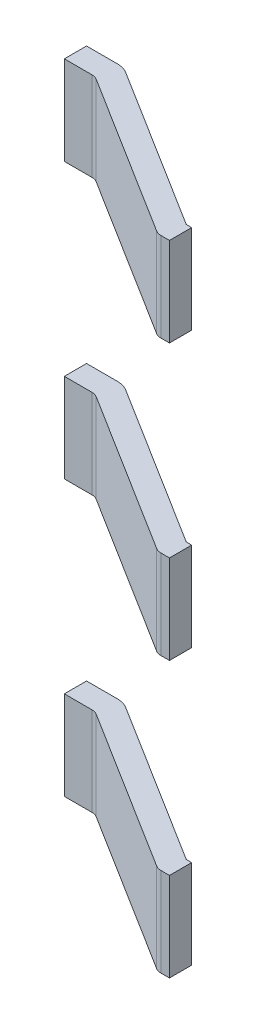
ISO-10303-21;
HEADER;
FILE_DESCRIPTION(('STEP AP214'),'2;1');
FILE_NAME('part.step','',(''),(''),'','','');
FILE_SCHEMA(('AUTOMOTIVE_DESIGN { 1 0 10303 214 1 1 1 1 }'));
ENDSEC;
DATA;
#1=APPLICATION_CONTEXT('core data for automotive mechanical design processes');
#2=APPLICATION_PROTOCOL_DEFINITION('international standard','automotive_design',2000,#1);
#3=PRODUCT_CONTEXT('',#1,'mechanical');
#4=PRODUCT('Part','Part','',(#3));
#5=PRODUCT_RELATED_PRODUCT_CATEGORY('part','',(#4));
#6=PRODUCT_DEFINITION_FORMATION('','',#4);
#7=PRODUCT_DEFINITION_CONTEXT('part definition',#1,'design');
#8=PRODUCT_DEFINITION('design','',#6,#7);
#9=PRODUCT_DEFINITION_SHAPE('','',#8);
#10=(LENGTH_UNIT() NAMED_UNIT(*) SI_UNIT(.MILLI.,.METRE.));
#11=(NAMED_UNIT(*) PLANE_ANGLE_UNIT() SI_UNIT($,.RADIAN.));
#12=(NAMED_UNIT(*) SI_UNIT($,.STERADIAN.) SOLID_ANGLE_UNIT());
#13=UNCERTAINTY_MEASURE_WITH_UNIT(LENGTH_MEASURE(1.E-05),#10,'distance_accuracy_value','');
#14=(GEOMETRIC_REPRESENTATION_CONTEXT(3) GLOBAL_UNCERTAINTY_ASSIGNED_CONTEXT((#13)) GLOBAL_UNIT_ASSIGNED_CONTEXT((#10,
#11,#12)) REPRESENTATION_CONTEXT('',''));
#15=CARTESIAN_POINT('',(0.,0.,0.));
#16=DIRECTION('',(0.,0.,1.));
#17=DIRECTION('',(1.,0.,0.));
#18=AXIS2_PLACEMENT_3D('',#15,#16,#17);
#19=CARTESIAN_POINT('',(-1.824104576066,1.92,0.964303036979));
#20=DIRECTION('',(0.,1.,0.));
#21=DIRECTION('',(-0.530661276733133,0.,0.847583983671212));
#22=AXIS2_PLACEMENT_3D('',#19,#20,#21);
#23=CYLINDRICAL_SURFACE('',#22,0.0925);
#24=CARTESIAN_POINT('',(-1.824104576066,1.92,0.964303036979));
#25=DIRECTION('',(0.,1.,0.));
#26=DIRECTION('',(0.,0.,1.));
#27=AXIS2_PLACEMENT_3D('',#24,#25,#26);
#28=CIRCLE('',#27,0.0925);
#29=CARTESIAN_POINT('',(-1.873190744164,1.92,1.042704555469));
#30=VERTEX_POINT('',#29);
#31=CARTESIAN_POINT('',(-1.824104576066,1.92,1.056803036979));
#32=VERTEX_POINT('',#31);
#33=EDGE_CURVE('P0_E163',#30,#32,#28,.T.);
#34=ORIENTED_EDGE('',*,*,#33,.T.);
#35=DIRECTION('',(0.,1.,0.));
#36=VECTOR('',#35,1.);
#37=CARTESIAN_POINT('',(-1.824104576066,1.92,1.056803036979));
#38=LINE('',#37,#36);
#39=CARTESIAN_POINT('',(-1.824104576066,2.66,1.056803036979));
#40=VERTEX_POINT('',#39);
#41=EDGE_CURVE('P0_E11',#32,#40,#38,.T.);
#42=ORIENTED_EDGE('',*,*,#41,.T.);
#43=CARTESIAN_POINT('',(-1.824104576066,2.66,0.964303036979));
#44=DIRECTION('',(0.,1.,0.));
#45=DIRECTION('',(0.,0.,1.));
#46=AXIS2_PLACEMENT_3D('',#43,#44,#45);
#47=CIRCLE('',#46,0.0925);
#48=CARTESIAN_POINT('',(-1.873190744164,2.66,1.042704555469));
#49=VERTEX_POINT('',#48);
#50=EDGE_CURVE('P0_E183',#49,#40,#47,.T.);
#51=ORIENTED_EDGE('',*,*,#50,.F.);
#52=DIRECTION('',(0.,1.,0.));
#53=VECTOR('',#52,1.);
#54=CARTESIAN_POINT('',(-1.873190744164,1.92,1.042704555469));
#55=LINE('',#54,#53);
#56=EDGE_CURVE('P0_E26',#30,#49,#55,.T.);
#57=ORIENTED_EDGE('',*,*,#56,.F.);
#58=EDGE_LOOP('',(#34,#42,#51,#57));
#59=FACE_BOUND('',#58,.T.);
#60=ADVANCED_FACE('P0_F17',(#59),#23,.T.);
#61=CARTESIAN_POINT('',(-1.850672336196,1.92,1.056803036979));
#62=DIRECTION('',(0.,0.,1.));
#63=DIRECTION('',(1.,0.,0.));
#64=AXIS2_PLACEMENT_3D('',#61,#62,#63);
#65=PLANE('',#64);
#66=DIRECTION('',(1.,0.,0.));
#67=VECTOR('',#66,1.);
#68=CARTESIAN_POINT('',(-1.850672336196,1.92,1.056803036979));
#69=LINE('',#68,#67);
#70=CARTESIAN_POINT('',(-1.7525,1.92,1.056803036979));
#71=VERTEX_POINT('',#70);
#72=EDGE_CURVE('P0_E194',#32,#71,#69,.T.);
#73=ORIENTED_EDGE('',*,*,#72,.T.);
#74=DIRECTION('',(0.,1.,0.));
#75=VECTOR('',#74,1.);
#76=CARTESIAN_POINT('',(-1.7525,1.92,1.056803036979));
#77=LINE('',#76,#75);
#78=CARTESIAN_POINT('',(-1.7525,2.66,1.056803036979));
#79=VERTEX_POINT('',#78);
#80=EDGE_CURVE('P0_E227',#71,#79,#77,.T.);
#81=ORIENTED_EDGE('',*,*,#80,.T.);
#82=DIRECTION('',(1.,0.,0.));
#83=VECTOR('',#82,1.);
#84=CARTESIAN_POINT('',(-1.850672336196,2.66,1.056803036979));
#85=LINE('',#84,#83);
#86=EDGE_CURVE('P0_E187',#40,#79,#85,.T.);
#87=ORIENTED_EDGE('',*,*,#86,.F.);
#88=ORIENTED_EDGE('',*,*,#41,.F.);
#89=EDGE_LOOP('',(#73,#81,#87,#88));
#90=FACE_BOUND('',#89,.T.);
#91=ADVANCED_FACE('P0_F438',(#90),#65,.T.);
#92=CARTESIAN_POINT('',(-3.288172336196,1.92,0.156803036979));
#93=DIRECTION('',(0.530661276733133,0.,-0.847583983671212));
#94=DIRECTION('',(0.,-1.,0.));
#95=AXIS2_PLACEMENT_3D('',#92,#93,#94);
#96=PLANE('',#95);
#97=ORIENTED_EDGE('',*,*,#56,.T.);
#98=DIRECTION('',(0.847583983671212,0.,0.530661276733133));
#99=VECTOR('',#98,1.);
#100=CARTESIAN_POINT('',(-3.288172336196,2.66,0.156803036979));
#101=LINE('',#100,#99);
#102=CARTESIAN_POINT('',(-3.220617112292,2.66,0.19909848151));
#103=VERTEX_POINT('',#102);
#104=EDGE_CURVE('P0_E188',#103,#49,#101,.T.);
#105=ORIENTED_EDGE('',*,*,#104,.F.);
#106=DIRECTION('',(0.,1.,0.));
#107=VECTOR('',#106,1.);
#108=CARTESIAN_POINT('',(-3.220617112292,1.92,0.19909848151));
#109=LINE('',#108,#107);
#110=CARTESIAN_POINT('',(-3.220617112292,1.92,0.19909848151));
#111=VERTEX_POINT('',#110);
#112=EDGE_CURVE('P0_E179',#111,#103,#109,.T.);
#113=ORIENTED_EDGE('',*,*,#112,.F.);
#114=DIRECTION('',(0.847583983671212,0.,0.530661276733133));
#115=VECTOR('',#114,1.);
#116=CARTESIAN_POINT('',(-3.288172336196,1.92,0.156803036979));
#117=LINE('',#116,#115);
#118=EDGE_CURVE('P0_E240',#111,#30,#117,.T.);
#119=ORIENTED_EDGE('',*,*,#118,.T.);
#120=EDGE_LOOP('',(#97,#105,#113,#119));
#121=FACE_BOUND('',#120,.T.);
#122=ADVANCED_FACE('P0_F19',(#121),#96,.F.);
#123=CARTESIAN_POINT('',(-1.7525,1.92,0.871803036979));
#124=DIRECTION('',(1.,0.,0.));
#125=DIRECTION('',(0.,1.,0.));
#126=AXIS2_PLACEMENT_3D('',#123,#124,#125);
#127=PLANE('',#126);
#128=DIRECTION('',(0.,0.,1.));
#129=VECTOR('',#128,1.);
#130=CARTESIAN_POINT('',(-1.7525,1.92,0.871803036979));
#131=LINE('',#130,#129);
#132=CARTESIAN_POINT('',(-1.7525,1.92,0.871803036979));
#133=VERTEX_POINT('',#132);
#134=EDGE_CURVE('P0_E197',#133,#71,#131,.T.);
#135=ORIENTED_EDGE('',*,*,#134,.F.);
#136=DIRECTION('',(0.,1.,0.));
#137=VECTOR('',#136,1.);
#138=CARTESIAN_POINT('',(-1.7525,1.92,0.871803036979));
#139=LINE('',#138,#137);
#140=CARTESIAN_POINT('',(-1.7525,2.66,0.871803036979));
#141=VERTEX_POINT('',#140);
#142=EDGE_CURVE('P0_E230',#133,#141,#139,.T.);
#143=ORIENTED_EDGE('',*,*,#142,.T.);
#144=DIRECTION('',(0.,0.,1.));
#145=VECTOR('',#144,1.);
#146=CARTESIAN_POINT('',(-1.7525,2.66,0.871803036979));
#147=LINE('',#146,#145);
#148=EDGE_CURVE('P0_E205',#141,#79,#147,.T.);
#149=ORIENTED_EDGE('',*,*,#148,.T.);
#150=ORIENTED_EDGE('',*,*,#80,.F.);
#151=EDGE_LOOP('',(#135,#143,#149,#150));
#152=FACE_BOUND('',#151,.T.);
#153=ADVANCED_FACE('P0_F432',(#152),#127,.T.);
#154=CARTESIAN_POINT('',(-1.850672336196,1.92,0.871803036979));
#155=DIRECTION('',(0.,0.,1.));
#156=DIRECTION('',(1.,0.,0.));
#157=AXIS2_PLACEMENT_3D('',#154,#155,#156);
#158=PLANE('',#157);
#159=ORIENTED_EDGE('',*,*,#142,.F.);
#160=DIRECTION('',(1.,0.,0.));
#161=VECTOR('',#160,1.);
#162=CARTESIAN_POINT('',(-1.850672336196,1.92,0.871803036979));
#163=LINE('',#162,#161);
#164=CARTESIAN_POINT('',(-1.797536815936,1.92,0.871803036979));
#165=VERTEX_POINT('',#164);
#166=EDGE_CURVE('P0_E171',#165,#133,#163,.T.);
#167=ORIENTED_EDGE('',*,*,#166,.F.);
#168=DIRECTION('',(0.,1.,0.));
#169=VECTOR('',#168,1.);
#170=CARTESIAN_POINT('',(-1.797536815936,1.92,0.871803036979));
#171=LINE('',#170,#169);
#172=CARTESIAN_POINT('',(-1.797536815936,2.66,0.871803036979));
#173=VERTEX_POINT('',#172);
#174=EDGE_CURVE('P0_E249',#165,#173,#171,.T.);
#175=ORIENTED_EDGE('',*,*,#174,.T.);
#176=DIRECTION('',(1.,0.,0.));
#177=VECTOR('',#176,1.);
#178=CARTESIAN_POINT('',(-1.850672336196,2.66,0.871803036979));
#179=LINE('',#178,#177);
#180=EDGE_CURVE('P0_E206',#173,#141,#179,.T.);
#181=ORIENTED_EDGE('',*,*,#180,.T.);
#182=EDGE_LOOP('',(#159,#167,#175,#181));
#183=FACE_BOUND('',#182,.T.);
#184=ADVANCED_FACE('P0_F379',(#183),#158,.F.);
#185=CARTESIAN_POINT('',(-3.19,1.92,0.));
#186=DIRECTION('',(0.530661276733133,0.,-0.847583983671212));
#187=DIRECTION('',(0.,-1.,0.));
#188=AXIS2_PLACEMENT_3D('',#185,#186,#187);
#189=PLANE('',#188);
#190=DIRECTION('',(0.847583983671212,0.,0.530661276733133));
#191=VECTOR('',#190,1.);
#192=CARTESIAN_POINT('',(-3.19,1.92,0.));
#193=LINE('',#192,#191);
#194=CARTESIAN_POINT('',(-3.144963184064,1.92,0.02819696302084));
#195=VERTEX_POINT('',#194);
#196=EDGE_CURVE('P0_E167',#195,#165,#193,.T.);
#197=ORIENTED_EDGE('',*,*,#196,.F.);
#198=DIRECTION('',(0.,1.,0.));
#199=VECTOR('',#198,1.);
#200=CARTESIAN_POINT('',(-3.144963184064,1.92,0.02819696302084));
#201=LINE('',#200,#199);
#202=CARTESIAN_POINT('',(-3.144963184064,2.66,0.02819696302084));
#203=VERTEX_POINT('',#202);
#204=EDGE_CURVE('P0_E246',#195,#203,#201,.T.);
#205=ORIENTED_EDGE('',*,*,#204,.T.);
#206=DIRECTION('',(0.847583983671212,0.,0.530661276733133));
#207=VECTOR('',#206,1.);
#208=CARTESIAN_POINT('',(-3.19,2.66,0.));
#209=LINE('',#208,#207);
#210=EDGE_CURVE('P0_E201',#203,#173,#209,.T.);
#211=ORIENTED_EDGE('',*,*,#210,.T.);
#212=ORIENTED_EDGE('',*,*,#174,.F.);
#213=EDGE_LOOP('',(#197,#205,#211,#212));
#214=FACE_BOUND('',#213,.T.);
#215=ADVANCED_FACE('P0_F373',(#214),#189,.T.);
#216=CARTESIAN_POINT('',(-3.24313552026,1.92,0.185));
#217=DIRECTION('',(0.,1.,0.));
#218=DIRECTION('',(0.,0.,-1.));
#219=AXIS2_PLACEMENT_3D('',#216,#217,#218);
#220=CYLINDRICAL_SURFACE('',#219,0.185);
#221=DIRECTION('',(0.,1.,0.));
#222=VECTOR('',#221,1.);
#223=CARTESIAN_POINT('',(-3.24313552026,1.92,0.));
#224=LINE('',#223,#222);
#225=CARTESIAN_POINT('',(-3.24313552026,1.92,0.));
#226=VERTEX_POINT('',#225);
#227=CARTESIAN_POINT('',(-3.24313552026,2.66,0.));
#228=VERTEX_POINT('',#227);
#229=EDGE_CURVE('P0_E243',#226,#228,#224,.T.);
#230=ORIENTED_EDGE('',*,*,#229,.T.);
#231=CARTESIAN_POINT('',(-3.24313552026,2.66,0.185));
#232=DIRECTION('',(0.,-1.,0.));
#233=DIRECTION('',(0.,0.,1.));
#234=AXIS2_PLACEMENT_3D('',#231,#232,#233);
#235=CIRCLE('',#234,0.185);
#236=EDGE_CURVE('P0_E180',#228,#203,#235,.T.);
#237=ORIENTED_EDGE('',*,*,#236,.T.);
#238=ORIENTED_EDGE('',*,*,#204,.F.);
#239=CARTESIAN_POINT('',(-3.24313552026,1.92,0.185));
#240=DIRECTION('',(0.,-1.,0.));
#241=DIRECTION('',(0.,0.,1.));
#242=AXIS2_PLACEMENT_3D('',#239,#240,#241);
#243=CIRCLE('',#242,0.185);
#244=EDGE_CURVE('P0_E172',#226,#195,#243,.T.);
#245=ORIENTED_EDGE('',*,*,#244,.F.);
#246=EDGE_LOOP('',(#230,#237,#238,#245));
#247=FACE_BOUND('',#246,.T.);
#248=ADVANCED_FACE('P0_F378',(#247),#220,.T.);
#249=CARTESIAN_POINT('',(-3.5,1.92,0.));
#250=DIRECTION('',(0.,0.,1.));
#251=DIRECTION('',(1.,0.,0.));
#252=AXIS2_PLACEMENT_3D('',#249,#250,#251);
#253=PLANE('',#252);
#254=ORIENTED_EDGE('',*,*,#229,.F.);
#255=DIRECTION('',(1.,0.,0.));
#256=VECTOR('',#255,1.);
#257=CARTESIAN_POINT('',(-3.5,1.92,0.));
#258=LINE('',#257,#256);
#259=CARTESIAN_POINT('',(-3.5,1.92,0.));
#260=VERTEX_POINT('',#259);
#261=EDGE_CURVE('P0_E223',#260,#226,#258,.T.);
#262=ORIENTED_EDGE('',*,*,#261,.F.);
#263=DIRECTION('',(0.,1.,0.));
#264=VECTOR('',#263,1.);
#265=CARTESIAN_POINT('',(-3.5,1.92,0.));
#266=LINE('',#265,#264);
#267=CARTESIAN_POINT('',(-3.5,2.66,0.));
#268=VERTEX_POINT('',#267);
#269=EDGE_CURVE('P0_E218',#260,#268,#266,.T.);
#270=ORIENTED_EDGE('',*,*,#269,.T.);
#271=DIRECTION('',(1.,0.,0.));
#272=VECTOR('',#271,1.);
#273=CARTESIAN_POINT('',(-3.5,2.66,0.));
#274=LINE('',#273,#272);
#275=EDGE_CURVE('P0_E136',#268,#228,#274,.T.);
#276=ORIENTED_EDGE('',*,*,#275,.T.);
#277=EDGE_LOOP('',(#254,#262,#270,#276));
#278=FACE_BOUND('',#277,.T.);
#279=ADVANCED_FACE('P0_F410',(#278),#253,.F.);
#280=CARTESIAN_POINT('',(-2.614100714426,1.92,0.486101794686));
#281=DIRECTION('',(0.,-1.,0.));
#282=DIRECTION('',(0.,0.,-1.));
#283=AXIS2_PLACEMENT_3D('',#280,#281,#282);
#284=PLANE('',#283);
#285=ORIENTED_EDGE('',*,*,#261,.T.);
#286=ORIENTED_EDGE('',*,*,#244,.T.);
#287=ORIENTED_EDGE('',*,*,#196,.T.);
#288=ORIENTED_EDGE('',*,*,#166,.T.);
#289=ORIENTED_EDGE('',*,*,#134,.T.);
#290=ORIENTED_EDGE('',*,*,#72,.F.);
#291=ORIENTED_EDGE('',*,*,#33,.F.);
#292=ORIENTED_EDGE('',*,*,#118,.F.);
#293=CARTESIAN_POINT('',(-3.269703280389,1.92,0.2775));
#294=DIRECTION('',(0.,-1.,0.));
#295=DIRECTION('',(0.,0.,1.));
#296=AXIS2_PLACEMENT_3D('',#293,#294,#295);
#297=CIRCLE('',#296,0.0925);
#298=CARTESIAN_POINT('',(-3.269703280389,1.92,0.185));
#299=VERTEX_POINT('',#298);
#300=EDGE_CURVE('P0_E175',#299,#111,#297,.T.);
#301=ORIENTED_EDGE('',*,*,#300,.F.);
#302=DIRECTION('',(1.,0.,0.));
#303=VECTOR('',#302,1.);
#304=CARTESIAN_POINT('',(-3.5,1.92,0.185));
#305=LINE('',#304,#303);
#306=CARTESIAN_POINT('',(-3.5,1.92,0.185));
#307=VERTEX_POINT('',#306);
#308=EDGE_CURVE('P0_E151',#307,#299,#305,.T.);
#309=ORIENTED_EDGE('',*,*,#308,.F.);
#310=DIRECTION('',(0.,0.,1.));
#311=VECTOR('',#310,1.);
#312=CARTESIAN_POINT('',(-3.5,1.92,0.));
#313=LINE('',#312,#311);
#314=EDGE_CURVE('P0_E146',#260,#307,#313,.T.);
#315=ORIENTED_EDGE('',*,*,#314,.F.);
#316=EDGE_LOOP('',(#285,#286,#287,#288,#289,#290,#291,#292,#301,#309,#315));
#317=FACE_BOUND('',#316,.T.);
#318=ADVANCED_FACE('P0_F263',(#317),#284,.T.);
#319=CARTESIAN_POINT('',(-3.5,1.92,0.));
#320=DIRECTION('',(1.,0.,0.));
#321=DIRECTION('',(0.,1.,0.));
#322=AXIS2_PLACEMENT_3D('',#319,#320,#321);
#323=PLANE('',#322);
#324=DIRECTION('',(0.,1.,0.));
#325=VECTOR('',#324,1.);
#326=CARTESIAN_POINT('',(-3.5,1.92,0.185));
#327=LINE('',#326,#325);
#328=CARTESIAN_POINT('',(-3.5,2.66,0.185));
#329=VERTEX_POINT('',#328);
#330=EDGE_CURVE('P0_E143',#307,#329,#327,.T.);
#331=ORIENTED_EDGE('',*,*,#330,.T.);
#332=DIRECTION('',(0.,0.,1.));
#333=VECTOR('',#332,1.);
#334=CARTESIAN_POINT('',(-3.5,2.66,0.));
#335=LINE('',#334,#333);
#336=EDGE_CURVE('P0_E128',#268,#329,#335,.T.);
#337=ORIENTED_EDGE('',*,*,#336,.F.);
#338=ORIENTED_EDGE('',*,*,#269,.F.);
#339=ORIENTED_EDGE('',*,*,#314,.T.);
#340=EDGE_LOOP('',(#331,#337,#338,#339));
#341=FACE_BOUND('',#340,.T.);
#342=ADVANCED_FACE('P0_F144',(#341),#323,.F.);
#343=CARTESIAN_POINT('',(-3.269703280389,1.92,0.2775));
#344=DIRECTION('',(0.,1.,0.));
#345=DIRECTION('',(0.,0.,-1.));
#346=AXIS2_PLACEMENT_3D('',#343,#344,#345);
#347=CYLINDRICAL_SURFACE('',#346,0.0925);
#348=ORIENTED_EDGE('',*,*,#300,.T.);
#349=ORIENTED_EDGE('',*,*,#112,.T.);
#350=CARTESIAN_POINT('',(-3.269703280389,2.66,0.2775));
#351=DIRECTION('',(0.,-1.,0.));
#352=DIRECTION('',(0.,0.,1.));
#353=AXIS2_PLACEMENT_3D('',#350,#351,#352);
#354=CIRCLE('',#353,0.0925);
#355=CARTESIAN_POINT('',(-3.269703280389,2.66,0.185));
#356=VERTEX_POINT('',#355);
#357=EDGE_CURVE('P0_E140',#356,#103,#354,.T.);
#358=ORIENTED_EDGE('',*,*,#357,.F.);
#359=DIRECTION('',(0.,1.,0.));
#360=VECTOR('',#359,1.);
#361=CARTESIAN_POINT('',(-3.269703280389,1.92,0.185));
#362=LINE('',#361,#360);
#363=EDGE_CURVE('P0_E156',#299,#356,#362,.T.);
#364=ORIENTED_EDGE('',*,*,#363,.F.);
#365=EDGE_LOOP('',(#348,#349,#358,#364));
#366=FACE_BOUND('',#365,.T.);
#367=ADVANCED_FACE('P0_F261',(#366),#347,.F.);
#368=CARTESIAN_POINT('',(-2.614100714426,2.66,0.486101794686));
#369=DIRECTION('',(0.,1.,0.));
#370=DIRECTION('',(0.,0.,-1.));
#371=AXIS2_PLACEMENT_3D('',#368,#369,#370);
#372=PLANE('',#371);
#373=ORIENTED_EDGE('',*,*,#275,.F.);
#374=ORIENTED_EDGE('',*,*,#336,.T.);
#375=DIRECTION('',(1.,0.,0.));
#376=VECTOR('',#375,1.);
#377=CARTESIAN_POINT('',(-3.5,2.66,0.185));
#378=LINE('',#377,#376);
#379=EDGE_CURVE('P0_E133',#329,#356,#378,.T.);
#380=ORIENTED_EDGE('',*,*,#379,.T.);
#381=ORIENTED_EDGE('',*,*,#357,.T.);
#382=ORIENTED_EDGE('',*,*,#104,.T.);
#383=ORIENTED_EDGE('',*,*,#50,.T.);
#384=ORIENTED_EDGE('',*,*,#86,.T.);
#385=ORIENTED_EDGE('',*,*,#148,.F.);
#386=ORIENTED_EDGE('',*,*,#180,.F.);
#387=ORIENTED_EDGE('',*,*,#210,.F.);
#388=ORIENTED_EDGE('',*,*,#236,.F.);
#389=EDGE_LOOP('',(#373,#374,#380,#381,#382,#383,#384,#385,#386,#387,#388));
#390=FACE_BOUND('',#389,.T.);
#391=ADVANCED_FACE('P0_F130',(#390),#372,.T.);
#392=CARTESIAN_POINT('',(-3.5,1.92,0.185));
#393=DIRECTION('',(0.,0.,1.));
#394=DIRECTION('',(1.,0.,0.));
#395=AXIS2_PLACEMENT_3D('',#392,#393,#394);
#396=PLANE('',#395);
#397=ORIENTED_EDGE('',*,*,#379,.F.);
#398=ORIENTED_EDGE('',*,*,#330,.F.);
#399=ORIENTED_EDGE('',*,*,#308,.T.);
#400=ORIENTED_EDGE('',*,*,#363,.T.);
#401=EDGE_LOOP('',(#397,#398,#399,#400));
#402=FACE_BOUND('',#401,.T.);
#403=ADVANCED_FACE('P0_F154',(#402),#396,.T.);
#404=CLOSED_SHELL('',(#60,#91,#122,#153,#184,#215,#248,#279,#318,#342,#367,#391,#403));
#405=MANIFOLD_SOLID_BREP('P0_B1',#404);
#406=CARTESIAN_POINT('',(-1.824104576066,-0.37,0.964303036979));
#407=DIRECTION('',(0.,1.,0.));
#408=DIRECTION('',(-0.530661276733133,0.,0.847583983671212));
#409=AXIS2_PLACEMENT_3D('',#406,#407,#408);
#410=CYLINDRICAL_SURFACE('',#409,0.0925);
#411=CARTESIAN_POINT('',(-1.824104576066,-0.37,0.964303036979));
#412=DIRECTION('',(0.,1.,0.));
#413=DIRECTION('',(0.,0.,1.));
#414=AXIS2_PLACEMENT_3D('',#411,#412,#413);
#415=CIRCLE('',#414,0.0925);
#416=CARTESIAN_POINT('',(-1.873190744164,-0.37,1.042704555469));
#417=VERTEX_POINT('',#416);
#418=CARTESIAN_POINT('',(-1.824104576066,-0.37,1.056803036979));
#419=VERTEX_POINT('',#418);
#420=EDGE_CURVE('P1_E198',#417,#419,#415,.T.);
#421=ORIENTED_EDGE('',*,*,#420,.T.);
#422=DIRECTION('',(0.,1.,0.));
#423=VECTOR('',#422,1.);
#424=CARTESIAN_POINT('',(-1.824104576066,-0.37,1.056803036979));
#425=LINE('',#424,#423);
#426=CARTESIAN_POINT('',(-1.824104576066,0.37,1.056803036979));
#427=VERTEX_POINT('',#426);
#428=EDGE_CURVE('P1_E11',#419,#427,#425,.T.);
#429=ORIENTED_EDGE('',*,*,#428,.T.);
#430=CARTESIAN_POINT('',(-1.824104576066,0.37,0.964303036979));
#431=DIRECTION('',(0.,1.,0.));
#432=DIRECTION('',(0.,0.,1.));
#433=AXIS2_PLACEMENT_3D('',#430,#431,#432);
#434=CIRCLE('',#433,0.0925);
#435=CARTESIAN_POINT('',(-1.873190744164,0.37,1.042704555469));
#436=VERTEX_POINT('',#435);
#437=EDGE_CURVE('P1_E220',#436,#427,#434,.T.);
#438=ORIENTED_EDGE('',*,*,#437,.F.);
#439=DIRECTION('',(0.,1.,0.));
#440=VECTOR('',#439,1.);
#441=CARTESIAN_POINT('',(-1.873190744164,-0.37,1.042704555469));
#442=LINE('',#441,#440);
#443=EDGE_CURVE('P1_E26',#417,#436,#442,.T.);
#444=ORIENTED_EDGE('',*,*,#443,.F.);
#445=EDGE_LOOP('',(#421,#429,#438,#444));
#446=FACE_BOUND('',#445,.T.);
#447=ADVANCED_FACE('P1_F17',(#446),#410,.T.);
#448=CARTESIAN_POINT('',(-1.850672336196,-0.37,1.056803036979));
#449=DIRECTION('',(0.,0.,1.));
#450=DIRECTION('',(1.,0.,0.));
#451=AXIS2_PLACEMENT_3D('',#448,#449,#450);
#452=PLANE('',#451);
#453=DIRECTION('',(1.,0.,0.));
#454=VECTOR('',#453,1.);
#455=CARTESIAN_POINT('',(-1.850672336196,-0.37,1.056803036979));
#456=LINE('',#455,#454);
#457=CARTESIAN_POINT('',(-1.7525,-0.37,1.056803036979));
#458=VERTEX_POINT('',#457);
#459=EDGE_CURVE('P1_E195',#419,#458,#456,.T.);
#460=ORIENTED_EDGE('',*,*,#459,.T.);
#461=DIRECTION('',(0.,1.,0.));
#462=VECTOR('',#461,1.);
#463=CARTESIAN_POINT('',(-1.7525,-0.37,1.056803036979));
#464=LINE('',#463,#462);
#465=CARTESIAN_POINT('',(-1.7525,0.37,1.056803036979));
#466=VERTEX_POINT('',#465);
#467=EDGE_CURVE('P1_E202',#458,#466,#464,.T.);
#468=ORIENTED_EDGE('',*,*,#467,.T.);
#469=DIRECTION('',(1.,0.,0.));
#470=VECTOR('',#469,1.);
#471=CARTESIAN_POINT('',(-1.850672336196,0.37,1.056803036979));
#472=LINE('',#471,#470);
#473=EDGE_CURVE('P1_E217',#427,#466,#472,.T.);
#474=ORIENTED_EDGE('',*,*,#473,.F.);
#475=ORIENTED_EDGE('',*,*,#428,.F.);
#476=EDGE_LOOP('',(#460,#468,#474,#475));
#477=FACE_BOUND('',#476,.T.);
#478=ADVANCED_FACE('P1_F19',(#477),#452,.T.);
#479=CARTESIAN_POINT('',(-3.288172336196,-0.37,0.156803036979));
#480=DIRECTION('',(0.530661276733133,0.,-0.847583983671212));
#481=DIRECTION('',(0.,-1.,0.));
#482=AXIS2_PLACEMENT_3D('',#479,#480,#481);
#483=PLANE('',#482);
#484=ORIENTED_EDGE('',*,*,#443,.T.);
#485=DIRECTION('',(0.847583983671212,0.,0.530661276733133));
#486=VECTOR('',#485,1.);
#487=CARTESIAN_POINT('',(-3.288172336196,0.37,0.156803036979));
#488=LINE('',#487,#486);
#489=CARTESIAN_POINT('',(-3.220617112292,0.37,0.19909848151));
#490=VERTEX_POINT('',#489);
#491=EDGE_CURVE('P1_E215',#490,#436,#488,.T.);
#492=ORIENTED_EDGE('',*,*,#491,.F.);
#493=DIRECTION('',(0.,1.,0.));
#494=VECTOR('',#493,1.);
#495=CARTESIAN_POINT('',(-3.220617112292,-0.37,0.19909848151));
#496=LINE('',#495,#494);
#497=CARTESIAN_POINT('',(-3.220617112292,-0.37,0.19909848151));
#498=VERTEX_POINT('',#497);
#499=EDGE_CURVE('P1_E168',#498,#490,#496,.T.);
#500=ORIENTED_EDGE('',*,*,#499,.F.);
#501=DIRECTION('',(0.847583983671212,0.,0.530661276733133));
#502=VECTOR('',#501,1.);
#503=CARTESIAN_POINT('',(-3.288172336196,-0.37,0.156803036979));
#504=LINE('',#503,#502);
#505=EDGE_CURVE('P1_E177',#498,#417,#504,.T.);
#506=ORIENTED_EDGE('',*,*,#505,.T.);
#507=EDGE_LOOP('',(#484,#492,#500,#506));
#508=FACE_BOUND('',#507,.T.);
#509=ADVANCED_FACE('P1_F284',(#508),#483,.F.);
#510=CARTESIAN_POINT('',(-1.7525,-0.37,0.871803036979));
#511=DIRECTION('',(1.,0.,0.));
#512=DIRECTION('',(0.,1.,0.));
#513=AXIS2_PLACEMENT_3D('',#510,#511,#512);
#514=PLANE('',#513);
#515=DIRECTION('',(0.,0.,1.));
#516=VECTOR('',#515,1.);
#517=CARTESIAN_POINT('',(-1.7525,-0.37,0.871803036979));
#518=LINE('',#517,#516);
#519=CARTESIAN_POINT('',(-1.7525,-0.37,0.871803036979));
#520=VERTEX_POINT('',#519);
#521=EDGE_CURVE('P1_E191',#520,#458,#518,.T.);
#522=ORIENTED_EDGE('',*,*,#521,.F.);
#523=DIRECTION('',(0.,1.,0.));
#524=VECTOR('',#523,1.);
#525=CARTESIAN_POINT('',(-1.7525,-0.37,0.871803036979));
#526=LINE('',#525,#524);
#527=CARTESIAN_POINT('',(-1.7525,0.37,0.871803036979));
#528=VERTEX_POINT('',#527);
#529=EDGE_CURVE('P1_E167',#520,#528,#526,.T.);
#530=ORIENTED_EDGE('',*,*,#529,.T.);
#531=DIRECTION('',(0.,0.,1.));
#532=VECTOR('',#531,1.);
#533=CARTESIAN_POINT('',(-1.7525,0.37,0.871803036979));
#534=LINE('',#533,#532);
#535=EDGE_CURVE('P1_E161',#528,#466,#534,.T.);
#536=ORIENTED_EDGE('',*,*,#535,.T.);
#537=ORIENTED_EDGE('',*,*,#467,.F.);
#538=EDGE_LOOP('',(#522,#530,#536,#537));
#539=FACE_BOUND('',#538,.T.);
#540=ADVANCED_FACE('P1_F286',(#539),#514,.T.);
#541=CARTESIAN_POINT('',(-1.850672336196,-0.37,0.871803036979));
#542=DIRECTION('',(0.,0.,1.));
#543=DIRECTION('',(1.,0.,0.));
#544=AXIS2_PLACEMENT_3D('',#541,#542,#543);
#545=PLANE('',#544);
#546=ORIENTED_EDGE('',*,*,#529,.F.);
#547=DIRECTION('',(1.,0.,0.));
#548=VECTOR('',#547,1.);
#549=CARTESIAN_POINT('',(-1.850672336196,-0.37,0.871803036979));
#550=LINE('',#549,#548);
#551=CARTESIAN_POINT('',(-1.797536815936,-0.37,0.871803036979));
#552=VERTEX_POINT('',#551);
#553=EDGE_CURVE('P1_E187',#552,#520,#550,.T.);
#554=ORIENTED_EDGE('',*,*,#553,.F.);
#555=DIRECTION('',(0.,1.,0.));
#556=VECTOR('',#555,1.);
#557=CARTESIAN_POINT('',(-1.797536815936,-0.37,0.871803036979));
#558=LINE('',#557,#556);
#559=CARTESIAN_POINT('',(-1.797536815936,0.37,0.871803036979));
#560=VERTEX_POINT('',#559);
#561=EDGE_CURVE('P1_E139',#552,#560,#558,.T.);
#562=ORIENTED_EDGE('',*,*,#561,.T.);
#563=DIRECTION('',(1.,0.,0.));
#564=VECTOR('',#563,1.);
#565=CARTESIAN_POINT('',(-1.850672336196,0.37,0.871803036979));
#566=LINE('',#565,#564);
#567=EDGE_CURVE('P1_E154',#560,#528,#566,.T.);
#568=ORIENTED_EDGE('',*,*,#567,.T.);
#569=EDGE_LOOP('',(#546,#554,#562,#568));
#570=FACE_BOUND('',#569,.T.);
#571=ADVANCED_FACE('P1_F292',(#570),#545,.F.);
#572=CARTESIAN_POINT('',(-3.19,-0.37,0.));
#573=DIRECTION('',(0.530661276733133,0.,-0.847583983671212));
#574=DIRECTION('',(0.,-1.,0.));
#575=AXIS2_PLACEMENT_3D('',#572,#573,#574);
#576=PLANE('',#575);
#577=DIRECTION('',(0.847583983671212,0.,0.530661276733133));
#578=VECTOR('',#577,1.);
#579=CARTESIAN_POINT('',(-3.19,-0.37,0.));
#580=LINE('',#579,#578);
#581=CARTESIAN_POINT('',(-3.144963184064,-0.37,0.02819696302084));
#582=VERTEX_POINT('',#581);
#583=EDGE_CURVE('P1_E134',#582,#552,#580,.T.);
#584=ORIENTED_EDGE('',*,*,#583,.F.);
#585=DIRECTION('',(0.,1.,0.));
#586=VECTOR('',#585,1.);
#587=CARTESIAN_POINT('',(-3.144963184064,-0.37,0.02819696302084));
#588=LINE('',#587,#586);
#589=CARTESIAN_POINT('',(-3.144963184064,0.37,0.02819696302084));
#590=VERTEX_POINT('',#589);
#591=EDGE_CURVE('P1_E127',#582,#590,#588,.T.);
#592=ORIENTED_EDGE('',*,*,#591,.T.);
#593=DIRECTION('',(0.847583983671212,0.,0.530661276733133));
#594=VECTOR('',#593,1.);
#595=CARTESIAN_POINT('',(-3.19,0.37,0.));
#596=LINE('',#595,#594);
#597=EDGE_CURVE('P1_E131',#590,#560,#596,.T.);
#598=ORIENTED_EDGE('',*,*,#597,.T.);
#599=ORIENTED_EDGE('',*,*,#561,.F.);
#600=EDGE_LOOP('',(#584,#592,#598,#599));
#601=FACE_BOUND('',#600,.T.);
#602=ADVANCED_FACE('P1_F129',(#601),#576,.T.);
#603=CARTESIAN_POINT('',(-3.24313552026,-0.37,0.185));
#604=DIRECTION('',(0.,1.,0.));
#605=DIRECTION('',(0.,0.,-1.));
#606=AXIS2_PLACEMENT_3D('',#603,#604,#605);
#607=CYLINDRICAL_SURFACE('',#606,0.185);
#608=DIRECTION('',(0.,1.,0.));
#609=VECTOR('',#608,1.);
#610=CARTESIAN_POINT('',(-3.24313552026,-0.37,0.));
#611=LINE('',#610,#609);
#612=CARTESIAN_POINT('',(-3.24313552026,-0.37,0.));
#613=VERTEX_POINT('',#612);
#614=CARTESIAN_POINT('',(-3.24313552026,0.37,0.));
#615=VERTEX_POINT('',#614);
#616=EDGE_CURVE('P1_E140',#613,#615,#611,.T.);
#617=ORIENTED_EDGE('',*,*,#616,.T.);
#618=CARTESIAN_POINT('',(-3.24313552026,0.37,0.185));
#619=DIRECTION('',(0.,-1.,0.));
#620=DIRECTION('',(0.,0.,1.));
#621=AXIS2_PLACEMENT_3D('',#618,#619,#620);
#622=CIRCLE('',#621,0.185);
#623=EDGE_CURVE('P1_E143',#615,#590,#622,.T.);
#624=ORIENTED_EDGE('',*,*,#623,.T.);
#625=ORIENTED_EDGE('',*,*,#591,.F.);
#626=CARTESIAN_POINT('',(-3.24313552026,-0.37,0.185));
#627=DIRECTION('',(0.,-1.,0.));
#628=DIRECTION('',(0.,0.,1.));
#629=AXIS2_PLACEMENT_3D('',#626,#627,#628);
#630=CIRCLE('',#629,0.185);
#631=EDGE_CURVE('P1_E182',#613,#582,#630,.T.);
#632=ORIENTED_EDGE('',*,*,#631,.F.);
#633=EDGE_LOOP('',(#617,#624,#625,#632));
#634=FACE_BOUND('',#633,.T.);
#635=ADVANCED_FACE('P1_F144',(#634),#607,.T.);
#636=CARTESIAN_POINT('',(-3.5,-0.37,0.));
#637=DIRECTION('',(0.,0.,1.));
#638=DIRECTION('',(1.,0.,0.));
#639=AXIS2_PLACEMENT_3D('',#636,#637,#638);
#640=PLANE('',#639);
#641=ORIENTED_EDGE('',*,*,#616,.F.);
#642=DIRECTION('',(1.,0.,0.));
#643=VECTOR('',#642,1.);
#644=CARTESIAN_POINT('',(-3.5,-0.37,0.));
#645=LINE('',#644,#643);
#646=CARTESIAN_POINT('',(-3.5,-0.37,0.));
#647=VERTEX_POINT('',#646);
#648=EDGE_CURVE('P1_E178',#647,#613,#645,.T.);
#649=ORIENTED_EDGE('',*,*,#648,.F.);
#650=DIRECTION('',(0.,1.,0.));
#651=VECTOR('',#650,1.);
#652=CARTESIAN_POINT('',(-3.5,-0.37,0.));
#653=LINE('',#652,#651);
#654=CARTESIAN_POINT('',(-3.5,0.37,0.));
#655=VERTEX_POINT('',#654);
#656=EDGE_CURVE('P1_E170',#647,#655,#653,.T.);
#657=ORIENTED_EDGE('',*,*,#656,.T.);
#658=DIRECTION('',(1.,0.,0.));
#659=VECTOR('',#658,1.);
#660=CARTESIAN_POINT('',(-3.5,0.37,0.));
#661=LINE('',#660,#659);
#662=EDGE_CURVE('P1_E238',#655,#615,#661,.T.);
#663=ORIENTED_EDGE('',*,*,#662,.T.);
#664=EDGE_LOOP('',(#641,#649,#657,#663));
#665=FACE_BOUND('',#664,.T.);
#666=ADVANCED_FACE('P1_F309',(#665),#640,.F.);
#667=CARTESIAN_POINT('',(-2.614100714426,-0.37,0.486101794686));
#668=DIRECTION('',(0.,-1.,0.));
#669=DIRECTION('',(0.,0.,-1.));
#670=AXIS2_PLACEMENT_3D('',#667,#668,#669);
#671=PLANE('',#670);
#672=ORIENTED_EDGE('',*,*,#648,.T.);
#673=ORIENTED_EDGE('',*,*,#631,.T.);
#674=ORIENTED_EDGE('',*,*,#583,.T.);
#675=ORIENTED_EDGE('',*,*,#553,.T.);
#676=ORIENTED_EDGE('',*,*,#521,.T.);
#677=ORIENTED_EDGE('',*,*,#459,.F.);
#678=ORIENTED_EDGE('',*,*,#420,.F.);
#679=ORIENTED_EDGE('',*,*,#505,.F.);
#680=CARTESIAN_POINT('',(-3.269703280389,-0.37,0.2775));
#681=DIRECTION('',(0.,-1.,0.));
#682=DIRECTION('',(0.,0.,1.));
#683=AXIS2_PLACEMENT_3D('',#680,#681,#682);
#684=CIRCLE('',#683,0.0925);
#685=CARTESIAN_POINT('',(-3.269703280389,-0.37,0.185));
#686=VERTEX_POINT('',#685);
#687=EDGE_CURVE('P1_E149',#686,#498,#684,.T.);
#688=ORIENTED_EDGE('',*,*,#687,.F.);
#689=DIRECTION('',(1.,0.,0.));
#690=VECTOR('',#689,1.);
#691=CARTESIAN_POINT('',(-3.5,-0.37,0.185));
#692=LINE('',#691,#690);
#693=CARTESIAN_POINT('',(-3.5,-0.37,0.185));
#694=VERTEX_POINT('',#693);
#695=EDGE_CURVE('P1_E249',#694,#686,#692,.T.);
#696=ORIENTED_EDGE('',*,*,#695,.F.);
#697=DIRECTION('',(0.,0.,1.));
#698=VECTOR('',#697,1.);
#699=CARTESIAN_POINT('',(-3.5,-0.37,0.));
#700=LINE('',#699,#698);
#701=EDGE_CURVE('P1_E174',#647,#694,#700,.T.);
#702=ORIENTED_EDGE('',*,*,#701,.F.);
#703=EDGE_LOOP('',(#672,#673,#674,#675,#676,#677,#678,#679,#688,#696,#702));
#704=FACE_BOUND('',#703,.T.);
#705=ADVANCED_FACE('P1_F280',(#704),#671,.T.);
#706=CARTESIAN_POINT('',(-3.5,-0.37,0.));
#707=DIRECTION('',(1.,0.,0.));
#708=DIRECTION('',(0.,1.,0.));
#709=AXIS2_PLACEMENT_3D('',#706,#707,#708);
#710=PLANE('',#709);
#711=DIRECTION('',(0.,1.,0.));
#712=VECTOR('',#711,1.);
#713=CARTESIAN_POINT('',(-3.5,-0.37,0.185));
#714=LINE('',#713,#712);
#715=CARTESIAN_POINT('',(-3.5,0.37,0.185));
#716=VERTEX_POINT('',#715);
#717=EDGE_CURVE('P1_E245',#694,#716,#714,.T.);
#718=ORIENTED_EDGE('',*,*,#717,.T.);
#719=DIRECTION('',(0.,0.,1.));
#720=VECTOR('',#719,1.);
#721=CARTESIAN_POINT('',(-3.5,0.37,0.));
#722=LINE('',#721,#720);
#723=EDGE_CURVE('P1_E232',#655,#716,#722,.T.);
#724=ORIENTED_EDGE('',*,*,#723,.F.);
#725=ORIENTED_EDGE('',*,*,#656,.F.);
#726=ORIENTED_EDGE('',*,*,#701,.T.);
#727=EDGE_LOOP('',(#718,#724,#725,#726));
#728=FACE_BOUND('',#727,.T.);
#729=ADVANCED_FACE('P1_F277',(#728),#710,.F.);
#730=CARTESIAN_POINT('',(-3.269703280389,-0.37,0.2775));
#731=DIRECTION('',(0.,1.,0.));
#732=DIRECTION('',(0.,0.,-1.));
#733=AXIS2_PLACEMENT_3D('',#730,#731,#732);
#734=CYLINDRICAL_SURFACE('',#733,0.0925);
#735=ORIENTED_EDGE('',*,*,#687,.T.);
#736=ORIENTED_EDGE('',*,*,#499,.T.);
#737=CARTESIAN_POINT('',(-3.269703280389,0.37,0.2775));
#738=DIRECTION('',(0.,-1.,0.));
#739=DIRECTION('',(0.,0.,1.));
#740=AXIS2_PLACEMENT_3D('',#737,#738,#739);
#741=CIRCLE('',#740,0.0925);
#742=CARTESIAN_POINT('',(-3.269703280389,0.37,0.185));
#743=VERTEX_POINT('',#742);
#744=EDGE_CURVE('P1_E227',#743,#490,#741,.T.);
#745=ORIENTED_EDGE('',*,*,#744,.F.);
#746=DIRECTION('',(0.,1.,0.));
#747=VECTOR('',#746,1.);
#748=CARTESIAN_POINT('',(-3.269703280389,-0.37,0.185));
#749=LINE('',#748,#747);
#750=EDGE_CURVE('P1_E252',#686,#743,#749,.T.);
#751=ORIENTED_EDGE('',*,*,#750,.F.);
#752=EDGE_LOOP('',(#735,#736,#745,#751));
#753=FACE_BOUND('',#752,.T.);
#754=ADVANCED_FACE('P1_F283',(#753),#734,.F.);
#755=CARTESIAN_POINT('',(-2.614100714426,0.37,0.486101794686));
#756=DIRECTION('',(0.,1.,0.));
#757=DIRECTION('',(0.,0.,-1.));
#758=AXIS2_PLACEMENT_3D('',#755,#756,#757);
#759=PLANE('',#758);
#760=ORIENTED_EDGE('',*,*,#662,.F.);
#761=ORIENTED_EDGE('',*,*,#723,.T.);
#762=DIRECTION('',(1.,0.,0.));
#763=VECTOR('',#762,1.);
#764=CARTESIAN_POINT('',(-3.5,0.37,0.185));
#765=LINE('',#764,#763);
#766=EDGE_CURVE('P1_E242',#716,#743,#765,.T.);
#767=ORIENTED_EDGE('',*,*,#766,.T.);
#768=ORIENTED_EDGE('',*,*,#744,.T.);
#769=ORIENTED_EDGE('',*,*,#491,.T.);
#770=ORIENTED_EDGE('',*,*,#437,.T.);
#771=ORIENTED_EDGE('',*,*,#473,.T.);
#772=ORIENTED_EDGE('',*,*,#535,.F.);
#773=ORIENTED_EDGE('',*,*,#567,.F.);
#774=ORIENTED_EDGE('',*,*,#597,.F.);
#775=ORIENTED_EDGE('',*,*,#623,.F.);
#776=EDGE_LOOP('',(#760,#761,#767,#768,#769,#770,#771,#772,#773,#774,#775));
#777=FACE_BOUND('',#776,.T.);
#778=ADVANCED_FACE('P1_F151',(#777),#759,.T.);
#779=CARTESIAN_POINT('',(-3.5,-0.37,0.185));
#780=DIRECTION('',(0.,0.,1.));
#781=DIRECTION('',(1.,0.,0.));
#782=AXIS2_PLACEMENT_3D('',#779,#780,#781);
#783=PLANE('',#782);
#784=ORIENTED_EDGE('',*,*,#766,.F.);
#785=ORIENTED_EDGE('',*,*,#717,.F.);
#786=ORIENTED_EDGE('',*,*,#695,.T.);
#787=ORIENTED_EDGE('',*,*,#750,.T.);
#788=EDGE_LOOP('',(#784,#785,#786,#787));
#789=FACE_BOUND('',#788,.T.);
#790=ADVANCED_FACE('P1_F270',(#789),#783,.T.);
#791=CLOSED_SHELL('',(#447,#478,#509,#540,#571,#602,#635,#666,#705,#729,#754,#778,#790));
#792=MANIFOLD_SOLID_BREP('P1_B1',#791);
#793=CARTESIAN_POINT('',(-1.824104576066,-2.66,0.964303036979));
#794=DIRECTION('',(0.,1.,0.));
#795=DIRECTION('',(-0.530661276733133,0.,0.847583983671212));
#796=AXIS2_PLACEMENT_3D('',#793,#794,#795);
#797=CYLINDRICAL_SURFACE('',#796,0.0925);
#798=CARTESIAN_POINT('',(-1.824104576066,-2.66,0.964303036979));
#799=DIRECTION('',(0.,1.,0.));
#800=DIRECTION('',(0.,0.,1.));
#801=AXIS2_PLACEMENT_3D('',#798,#799,#800);
#802=CIRCLE('',#801,0.0925);
#803=CARTESIAN_POINT('',(-1.873190744164,-2.66,1.042704555469));
#804=VERTEX_POINT('',#803);
#805=CARTESIAN_POINT('',(-1.824104576066,-2.66,1.056803036979));
#806=VERTEX_POINT('',#805);
#807=EDGE_CURVE('P2_E164',#804,#806,#802,.T.);
#808=ORIENTED_EDGE('',*,*,#807,.T.);
#809=DIRECTION('',(0.,1.,0.));
#810=VECTOR('',#809,1.);
#811=CARTESIAN_POINT('',(-1.824104576066,-2.66,1.056803036979));
#812=LINE('',#811,#810);
#813=CARTESIAN_POINT('',(-1.824104576066,-1.92,1.056803036979));
#814=VERTEX_POINT('',#813);
#815=EDGE_CURVE('P2_E11',#806,#814,#812,.T.);
#816=ORIENTED_EDGE('',*,*,#815,.T.);
#817=CARTESIAN_POINT('',(-1.824104576066,-1.92,0.964303036979));
#818=DIRECTION('',(0.,1.,0.));
#819=DIRECTION('',(0.,0.,1.));
#820=AXIS2_PLACEMENT_3D('',#817,#818,#819);
#821=CIRCLE('',#820,0.0925);
#822=CARTESIAN_POINT('',(-1.873190744164,-1.92,1.042704555469));
#823=VERTEX_POINT('',#822);
#824=EDGE_CURVE('P2_E179',#823,#814,#821,.T.);
#825=ORIENTED_EDGE('',*,*,#824,.F.);
#826=DIRECTION('',(0.,1.,0.));
#827=VECTOR('',#826,1.);
#828=CARTESIAN_POINT('',(-1.873190744164,-2.66,1.042704555469));
#829=LINE('',#828,#827);
#830=EDGE_CURVE('P2_E25',#804,#823,#829,.T.);
#831=ORIENTED_EDGE('',*,*,#830,.F.);
#832=EDGE_LOOP('',(#808,#816,#825,#831));
#833=FACE_BOUND('',#832,.T.);
#834=ADVANCED_FACE('P2_F17',(#833),#797,.T.);
#835=CARTESIAN_POINT('',(-1.850672336196,-2.66,1.056803036979));
#836=DIRECTION('',(0.,0.,1.));
#837=DIRECTION('',(1.,0.,0.));
#838=AXIS2_PLACEMENT_3D('',#835,#836,#837);
#839=PLANE('',#838);
#840=DIRECTION('',(1.,0.,0.));
#841=VECTOR('',#840,1.);
#842=CARTESIAN_POINT('',(-1.850672336196,-2.66,1.056803036979));
#843=LINE('',#842,#841);
#844=CARTESIAN_POINT('',(-1.7525,-2.66,1.056803036979));
#845=VERTEX_POINT('',#844);
#846=EDGE_CURVE('P2_E168',#806,#845,#843,.T.);
#847=ORIENTED_EDGE('',*,*,#846,.T.);
#848=DIRECTION('',(0.,1.,0.));
#849=VECTOR('',#848,1.);
#850=CARTESIAN_POINT('',(-1.7525,-2.66,1.056803036979));
#851=LINE('',#850,#849);
#852=CARTESIAN_POINT('',(-1.7525,-1.92,1.056803036979));
#853=VERTEX_POINT('',#852);
#854=EDGE_CURVE('P2_E219',#845,#853,#851,.T.);
#855=ORIENTED_EDGE('',*,*,#854,.T.);
#856=DIRECTION('',(1.,0.,0.));
#857=VECTOR('',#856,1.);
#858=CARTESIAN_POINT('',(-1.850672336196,-1.92,1.056803036979));
#859=LINE('',#858,#857);
#860=EDGE_CURVE('P2_E192',#814,#853,#859,.T.);
#861=ORIENTED_EDGE('',*,*,#860,.F.);
#862=ORIENTED_EDGE('',*,*,#815,.F.);
#863=EDGE_LOOP('',(#847,#855,#861,#862));
#864=FACE_BOUND('',#863,.T.);
#865=ADVANCED_FACE('P2_F265',(#864),#839,.T.);
#866=CARTESIAN_POINT('',(-3.288172336196,-2.66,0.156803036979));
#867=DIRECTION('',(0.530661276733133,0.,-0.847583983671212));
#868=DIRECTION('',(0.,-1.,0.));
#869=AXIS2_PLACEMENT_3D('',#866,#867,#868);
#870=PLANE('',#869);
#871=ORIENTED_EDGE('',*,*,#830,.T.);
#872=DIRECTION('',(0.847583983671212,0.,0.530661276733133));
#873=VECTOR('',#872,1.);
#874=CARTESIAN_POINT('',(-3.288172336196,-1.92,0.156803036979));
#875=LINE('',#874,#873);
#876=CARTESIAN_POINT('',(-3.220617112292,-1.92,0.19909848151));
#877=VERTEX_POINT('',#876);
#878=EDGE_CURVE('P2_E175',#877,#823,#875,.T.);
#879=ORIENTED_EDGE('',*,*,#878,.F.);
#880=DIRECTION('',(0.,1.,0.));
#881=VECTOR('',#880,1.);
#882=CARTESIAN_POINT('',(-3.220617112292,-2.66,0.19909848151));
#883=LINE('',#882,#881);
#884=CARTESIAN_POINT('',(-3.220617112292,-2.66,0.19909848151));
#885=VERTEX_POINT('',#884);
#886=EDGE_CURVE('P2_E184',#885,#877,#883,.T.);
#887=ORIENTED_EDGE('',*,*,#886,.F.);
#888=DIRECTION('',(0.847583983671212,0.,0.530661276733133));
#889=VECTOR('',#888,1.);
#890=CARTESIAN_POINT('',(-3.288172336196,-2.66,0.156803036979));
#891=LINE('',#890,#889);
#892=EDGE_CURVE('P2_E167',#885,#804,#891,.T.);
#893=ORIENTED_EDGE('',*,*,#892,.T.);
#894=EDGE_LOOP('',(#871,#879,#887,#893));
#895=FACE_BOUND('',#894,.T.);
#896=ADVANCED_FACE('P2_F255',(#895),#870,.F.);
#897=CARTESIAN_POINT('',(-1.7525,-2.66,0.871803036979));
#898=DIRECTION('',(1.,0.,0.));
#899=DIRECTION('',(0.,1.,0.));
#900=AXIS2_PLACEMENT_3D('',#897,#898,#899);
#901=PLANE('',#900);
#902=DIRECTION('',(0.,0.,1.));
#903=VECTOR('',#902,1.);
#904=CARTESIAN_POINT('',(-1.7525,-2.66,0.871803036979));
#905=LINE('',#904,#903);
#906=CARTESIAN_POINT('',(-1.7525,-2.66,0.871803036979));
#907=VERTEX_POINT('',#906);
#908=EDGE_CURVE('P2_E233',#907,#845,#905,.T.);
#909=ORIENTED_EDGE('',*,*,#908,.F.);
#910=DIRECTION('',(0.,1.,0.));
#911=VECTOR('',#910,1.);
#912=CARTESIAN_POINT('',(-1.7525,-2.66,0.871803036979));
#913=LINE('',#912,#911);
#914=CARTESIAN_POINT('',(-1.7525,-1.92,0.871803036979));
#915=VERTEX_POINT('',#914);
#916=EDGE_CURVE('P2_E216',#907,#915,#913,.T.);
#917=ORIENTED_EDGE('',*,*,#916,.T.);
#918=DIRECTION('',(0.,0.,1.));
#919=VECTOR('',#918,1.);
#920=CARTESIAN_POINT('',(-1.7525,-1.92,0.871803036979));
#921=LINE('',#920,#919);
#922=EDGE_CURVE('P2_E200',#915,#853,#921,.T.);
#923=ORIENTED_EDGE('',*,*,#922,.T.);
#924=ORIENTED_EDGE('',*,*,#854,.F.);
#925=EDGE_LOOP('',(#909,#917,#923,#924));
#926=FACE_BOUND('',#925,.T.);
#927=ADVANCED_FACE('P2_F268',(#926),#901,.T.);
#928=CARTESIAN_POINT('',(-1.850672336196,-2.66,0.871803036979));
#929=DIRECTION('',(0.,0.,1.));
#930=DIRECTION('',(1.,0.,0.));
#931=AXIS2_PLACEMENT_3D('',#928,#929,#930);
#932=PLANE('',#931);
#933=ORIENTED_EDGE('',*,*,#916,.F.);
#934=DIRECTION('',(1.,0.,0.));
#935=VECTOR('',#934,1.);
#936=CARTESIAN_POINT('',(-1.850672336196,-2.66,0.871803036979));
#937=LINE('',#936,#935);
#938=CARTESIAN_POINT('',(-1.797536815936,-2.66,0.871803036979));
#939=VERTEX_POINT('',#938);
#940=EDGE_CURVE('P2_E232',#939,#907,#937,.T.);
#941=ORIENTED_EDGE('',*,*,#940,.F.);
#942=DIRECTION('',(0.,1.,0.));
#943=VECTOR('',#942,1.);
#944=CARTESIAN_POINT('',(-1.797536815936,-2.66,0.871803036979));
#945=LINE('',#944,#943);
#946=CARTESIAN_POINT('',(-1.797536815936,-1.92,0.871803036979));
#947=VERTEX_POINT('',#946);
#948=EDGE_CURVE('P2_E220',#939,#947,#945,.T.);
#949=ORIENTED_EDGE('',*,*,#948,.T.);
#950=DIRECTION('',(1.,0.,0.));
#951=VECTOR('',#950,1.);
#952=CARTESIAN_POINT('',(-1.850672336196,-1.92,0.871803036979));
#953=LINE('',#952,#951);
#954=EDGE_CURVE('P2_E204',#947,#915,#953,.T.);
#955=ORIENTED_EDGE('',*,*,#954,.T.);
#956=EDGE_LOOP('',(#933,#941,#949,#955));
#957=FACE_BOUND('',#956,.T.);
#958=ADVANCED_FACE('P2_F272',(#957),#932,.F.);
#959=CARTESIAN_POINT('',(-3.19,-2.66,0.));
#960=DIRECTION('',(0.530661276733133,0.,-0.847583983671212));
#961=DIRECTION('',(0.,-1.,0.));
#962=AXIS2_PLACEMENT_3D('',#959,#960,#961);
#963=PLANE('',#962);
#964=DIRECTION('',(0.847583983671212,0.,0.530661276733133));
#965=VECTOR('',#964,1.);
#966=CARTESIAN_POINT('',(-3.19,-2.66,0.));
#967=LINE('',#966,#965);
#968=CARTESIAN_POINT('',(-3.144963184064,-2.66,0.02819696302084));
#969=VERTEX_POINT('',#968);
#970=EDGE_CURVE('P2_E228',#969,#939,#967,.T.);
#971=ORIENTED_EDGE('',*,*,#970,.F.);
#972=DIRECTION('',(0.,1.,0.));
#973=VECTOR('',#972,1.);
#974=CARTESIAN_POINT('',(-3.144963184064,-2.66,0.02819696302084));
#975=LINE('',#974,#973);
#976=CARTESIAN_POINT('',(-3.144963184064,-1.92,0.02819696302084));
#977=VERTEX_POINT('',#976);
#978=EDGE_CURVE('P2_E244',#969,#977,#975,.T.);
#979=ORIENTED_EDGE('',*,*,#978,.T.);
#980=DIRECTION('',(0.847583983671212,0.,0.530661276733133));
#981=VECTOR('',#980,1.);
#982=CARTESIAN_POINT('',(-3.19,-1.92,0.));
#983=LINE('',#982,#981);
#984=EDGE_CURVE('P2_E196',#977,#947,#983,.T.);
#985=ORIENTED_EDGE('',*,*,#984,.T.);
#986=ORIENTED_EDGE('',*,*,#948,.F.);
#987=EDGE_LOOP('',(#971,#979,#985,#986));
#988=FACE_BOUND('',#987,.T.);
#989=ADVANCED_FACE('P2_F276',(#988),#963,.T.);
#990=CARTESIAN_POINT('',(-3.24313552026,-2.66,0.185));
#991=DIRECTION('',(0.,1.,0.));
#992=DIRECTION('',(0.,0.,-1.));
#993=AXIS2_PLACEMENT_3D('',#990,#991,#992);
#994=CYLINDRICAL_SURFACE('',#993,0.185);
#995=DIRECTION('',(0.,1.,0.));
#996=VECTOR('',#995,1.);
#997=CARTESIAN_POINT('',(-3.24313552026,-2.66,0.));
#998=LINE('',#997,#996);
#999=CARTESIAN_POINT('',(-3.24313552026,-2.66,0.));
#1000=VERTEX_POINT('',#999);
#1001=CARTESIAN_POINT('',(-3.24313552026,-1.92,0.));
#1002=VERTEX_POINT('',#1001);
#1003=EDGE_CURVE('P2_E241',#1000,#1002,#998,.T.);
#1004=ORIENTED_EDGE('',*,*,#1003,.T.);
#1005=CARTESIAN_POINT('',(-3.24313552026,-1.92,0.185));
#1006=DIRECTION('',(0.,-1.,0.));
#1007=DIRECTION('',(0.,0.,1.));
#1008=AXIS2_PLACEMENT_3D('',#1005,#1006,#1007);
#1009=CIRCLE('',#1008,0.185);
#1010=EDGE_CURVE('P2_E185',#1002,#977,#1009,.T.);
#1011=ORIENTED_EDGE('',*,*,#1010,.T.);
#1012=ORIENTED_EDGE('',*,*,#978,.F.);
#1013=CARTESIAN_POINT('',(-3.24313552026,-2.66,0.185));
#1014=DIRECTION('',(0.,-1.,0.));
#1015=DIRECTION('',(0.,0.,1.));
#1016=AXIS2_PLACEMENT_3D('',#1013,#1014,#1015);
#1017=CIRCLE('',#1016,0.185);
#1018=EDGE_CURVE('P2_E224',#1000,#969,#1017,.T.);
#1019=ORIENTED_EDGE('',*,*,#1018,.F.);
#1020=EDGE_LOOP('',(#1004,#1011,#1012,#1019));
#1021=FACE_BOUND('',#1020,.T.);
#1022=ADVANCED_FACE('P2_F279',(#1021),#994,.T.);
#1023=CARTESIAN_POINT('',(-3.5,-2.66,0.));
#1024=DIRECTION('',(0.,0.,1.));
#1025=DIRECTION('',(1.,0.,0.));
#1026=AXIS2_PLACEMENT_3D('',#1023,#1024,#1025);
#1027=PLANE('',#1026);
#1028=ORIENTED_EDGE('',*,*,#1003,.F.);
#1029=DIRECTION('',(1.,0.,0.));
#1030=VECTOR('',#1029,1.);
#1031=CARTESIAN_POINT('',(-3.5,-2.66,0.));
#1032=LINE('',#1031,#1030);
#1033=CARTESIAN_POINT('',(-3.5,-2.66,0.));
#1034=VERTEX_POINT('',#1033);
#1035=EDGE_CURVE('P2_E215',#1034,#1000,#1032,.T.);
#1036=ORIENTED_EDGE('',*,*,#1035,.F.);
#1037=DIRECTION('',(0.,1.,0.));
#1038=VECTOR('',#1037,1.);
#1039=CARTESIAN_POINT('',(-3.5,-2.66,0.));
#1040=LINE('',#1039,#1038);
#1041=CARTESIAN_POINT('',(-3.5,-1.92,0.));
#1042=VERTEX_POINT('',#1041);
#1043=EDGE_CURVE('P2_E186',#1034,#1042,#1040,.T.);
#1044=ORIENTED_EDGE('',*,*,#1043,.T.);
#1045=DIRECTION('',(1.,0.,0.));
#1046=VECTOR('',#1045,1.);
#1047=CARTESIAN_POINT('',(-3.5,-1.92,0.));
#1048=LINE('',#1047,#1046);
#1049=EDGE_CURVE('P2_E135',#1042,#1002,#1048,.T.);
#1050=ORIENTED_EDGE('',*,*,#1049,.T.);
#1051=EDGE_LOOP('',(#1028,#1036,#1044,#1050));
#1052=FACE_BOUND('',#1051,.T.);
#1053=ADVANCED_FACE('P2_F281',(#1052),#1027,.F.);
#1054=CARTESIAN_POINT('',(-2.614100714426,-2.66,0.486101794686));
#1055=DIRECTION('',(0.,-1.,0.));
#1056=DIRECTION('',(0.,0.,-1.));
#1057=AXIS2_PLACEMENT_3D('',#1054,#1055,#1056);
#1058=PLANE('',#1057);
#1059=ORIENTED_EDGE('',*,*,#1035,.T.);
#1060=ORIENTED_EDGE('',*,*,#1018,.T.);
#1061=ORIENTED_EDGE('',*,*,#970,.T.);
#1062=ORIENTED_EDGE('',*,*,#940,.T.);
#1063=ORIENTED_EDGE('',*,*,#908,.T.);
#1064=ORIENTED_EDGE('',*,*,#846,.F.);
#1065=ORIENTED_EDGE('',*,*,#807,.F.);
#1066=ORIENTED_EDGE('',*,*,#892,.F.);
#1067=CARTESIAN_POINT('',(-3.269703280389,-2.66,0.2775));
#1068=DIRECTION('',(0.,-1.,0.));
#1069=DIRECTION('',(0.,0.,1.));
#1070=AXIS2_PLACEMENT_3D('',#1067,#1068,#1069);
#1071=CIRCLE('',#1070,0.0925);
#1072=CARTESIAN_POINT('',(-3.269703280389,-2.66,0.185));
#1073=VERTEX_POINT('',#1072);
#1074=EDGE_CURVE('P2_E180',#1073,#885,#1071,.T.);
#1075=ORIENTED_EDGE('',*,*,#1074,.F.);
#1076=DIRECTION('',(1.,0.,0.));
#1077=VECTOR('',#1076,1.);
#1078=CARTESIAN_POINT('',(-3.5,-2.66,0.185));
#1079=LINE('',#1078,#1077);
#1080=CARTESIAN_POINT('',(-3.5,-2.66,0.185));
#1081=VERTEX_POINT('',#1080);
#1082=EDGE_CURVE('P2_E150',#1081,#1073,#1079,.T.);
#1083=ORIENTED_EDGE('',*,*,#1082,.F.);
#1084=DIRECTION('',(0.,0.,1.));
#1085=VECTOR('',#1084,1.);
#1086=CARTESIAN_POINT('',(-3.5,-2.66,0.));
#1087=LINE('',#1086,#1085);
#1088=EDGE_CURVE('P2_E145',#1034,#1081,#1087,.T.);
#1089=ORIENTED_EDGE('',*,*,#1088,.F.);
#1090=EDGE_LOOP('',(#1059,#1060,#1061,#1062,#1063,#1064,#1065,#1066,#1075,#1083,#1089));
#1091=FACE_BOUND('',#1090,.T.);
#1092=ADVANCED_FACE('P2_F261',(#1091),#1058,.T.);
#1093=CARTESIAN_POINT('',(-3.5,-2.66,0.));
#1094=DIRECTION('',(1.,0.,0.));
#1095=DIRECTION('',(0.,1.,0.));
#1096=AXIS2_PLACEMENT_3D('',#1093,#1094,#1095);
#1097=PLANE('',#1096);
#1098=DIRECTION('',(0.,1.,0.));
#1099=VECTOR('',#1098,1.);
#1100=CARTESIAN_POINT('',(-3.5,-2.66,0.185));
#1101=LINE('',#1100,#1099);
#1102=CARTESIAN_POINT('',(-3.5,-1.92,0.185));
#1103=VERTEX_POINT('',#1102);
#1104=EDGE_CURVE('P2_E142',#1081,#1103,#1101,.T.);
#1105=ORIENTED_EDGE('',*,*,#1104,.T.);
#1106=DIRECTION('',(0.,0.,1.));
#1107=VECTOR('',#1106,1.);
#1108=CARTESIAN_POINT('',(-3.5,-1.92,0.));
#1109=LINE('',#1108,#1107);
#1110=EDGE_CURVE('P2_E127',#1042,#1103,#1109,.T.);
#1111=ORIENTED_EDGE('',*,*,#1110,.F.);
#1112=ORIENTED_EDGE('',*,*,#1043,.F.);
#1113=ORIENTED_EDGE('',*,*,#1088,.T.);
#1114=EDGE_LOOP('',(#1105,#1111,#1112,#1113));
#1115=FACE_BOUND('',#1114,.T.);
#1116=ADVANCED_FACE('P2_F143',(#1115),#1097,.F.);
#1117=CARTESIAN_POINT('',(-3.269703280389,-2.66,0.2775));
#1118=DIRECTION('',(0.,1.,0.));
#1119=DIRECTION('',(0.,0.,-1.));
#1120=AXIS2_PLACEMENT_3D('',#1117,#1118,#1119);
#1121=CYLINDRICAL_SURFACE('',#1120,0.0925);
#1122=ORIENTED_EDGE('',*,*,#1074,.T.);
#1123=ORIENTED_EDGE('',*,*,#886,.T.);
#1124=CARTESIAN_POINT('',(-3.269703280389,-1.92,0.2775));
#1125=DIRECTION('',(0.,-1.,0.));
#1126=DIRECTION('',(0.,0.,1.));
#1127=AXIS2_PLACEMENT_3D('',#1124,#1125,#1126);
#1128=CIRCLE('',#1127,0.0925);
#1129=CARTESIAN_POINT('',(-3.269703280389,-1.92,0.185));
#1130=VERTEX_POINT('',#1129);
#1131=EDGE_CURVE('P2_E139',#1130,#877,#1128,.T.);
#1132=ORIENTED_EDGE('',*,*,#1131,.F.);
#1133=DIRECTION('',(0.,1.,0.));
#1134=VECTOR('',#1133,1.);
#1135=CARTESIAN_POINT('',(-3.269703280389,-2.66,0.185));
#1136=LINE('',#1135,#1134);
#1137=EDGE_CURVE('P2_E155',#1073,#1130,#1136,.T.);
#1138=ORIENTED_EDGE('',*,*,#1137,.F.);
#1139=EDGE_LOOP('',(#1122,#1123,#1132,#1138));
#1140=FACE_BOUND('',#1139,.T.);
#1141=ADVANCED_FACE('P2_F259',(#1140),#1121,.F.);
#1142=CARTESIAN_POINT('',(-2.614100714426,-1.92,0.486101794686));
#1143=DIRECTION('',(0.,1.,0.));
#1144=DIRECTION('',(0.,0.,-1.));
#1145=AXIS2_PLACEMENT_3D('',#1142,#1143,#1144);
#1146=PLANE('',#1145);
#1147=ORIENTED_EDGE('',*,*,#1049,.F.);
#1148=ORIENTED_EDGE('',*,*,#1110,.T.);
#1149=DIRECTION('',(1.,0.,0.));
#1150=VECTOR('',#1149,1.);
#1151=CARTESIAN_POINT('',(-3.5,-1.92,0.185));
#1152=LINE('',#1151,#1150);
#1153=EDGE_CURVE('P2_E132',#1103,#1130,#1152,.T.);
#1154=ORIENTED_EDGE('',*,*,#1153,.T.);
#1155=ORIENTED_EDGE('',*,*,#1131,.T.);
#1156=ORIENTED_EDGE('',*,*,#878,.T.);
#1157=ORIENTED_EDGE('',*,*,#824,.T.);
#1158=ORIENTED_EDGE('',*,*,#860,.T.);
#1159=ORIENTED_EDGE('',*,*,#922,.F.);
#1160=ORIENTED_EDGE('',*,*,#954,.F.);
#1161=ORIENTED_EDGE('',*,*,#984,.F.);
#1162=ORIENTED_EDGE('',*,*,#1010,.F.);
#1163=EDGE_LOOP('',(#1147,#1148,#1154,#1155,#1156,#1157,#1158,#1159,#1160,#1161,#1162));
#1164=FACE_BOUND('',#1163,.T.);
#1165=ADVANCED_FACE('P2_F129',(#1164),#1146,.T.);
#1166=CARTESIAN_POINT('',(-3.5,-2.66,0.185));
#1167=DIRECTION('',(0.,0.,1.));
#1168=DIRECTION('',(1.,0.,0.));
#1169=AXIS2_PLACEMENT_3D('',#1166,#1167,#1168);
#1170=PLANE('',#1169);
#1171=ORIENTED_EDGE('',*,*,#1153,.F.);
#1172=ORIENTED_EDGE('',*,*,#1104,.F.);
#1173=ORIENTED_EDGE('',*,*,#1082,.T.);
#1174=ORIENTED_EDGE('',*,*,#1137,.T.);
#1175=EDGE_LOOP('',(#1171,#1172,#1173,#1174));
#1176=FACE_BOUND('',#1175,.T.);
#1177=ADVANCED_FACE('P2_F153',(#1176),#1170,.T.);
#1178=CLOSED_SHELL('',(#834,#865,#896,#927,#958,#989,#1022,#1053,#1092,#1116,#1141,#1165,#1177));
#1179=MANIFOLD_SOLID_BREP('P2_B1',#1178);
#1180=ADVANCED_BREP_SHAPE_REPRESENTATION('',(#18,#405,#792,#1179),#14);
#1181=SHAPE_DEFINITION_REPRESENTATION(#9,#1180);
ENDSEC;
END-ISO-10303-21;
